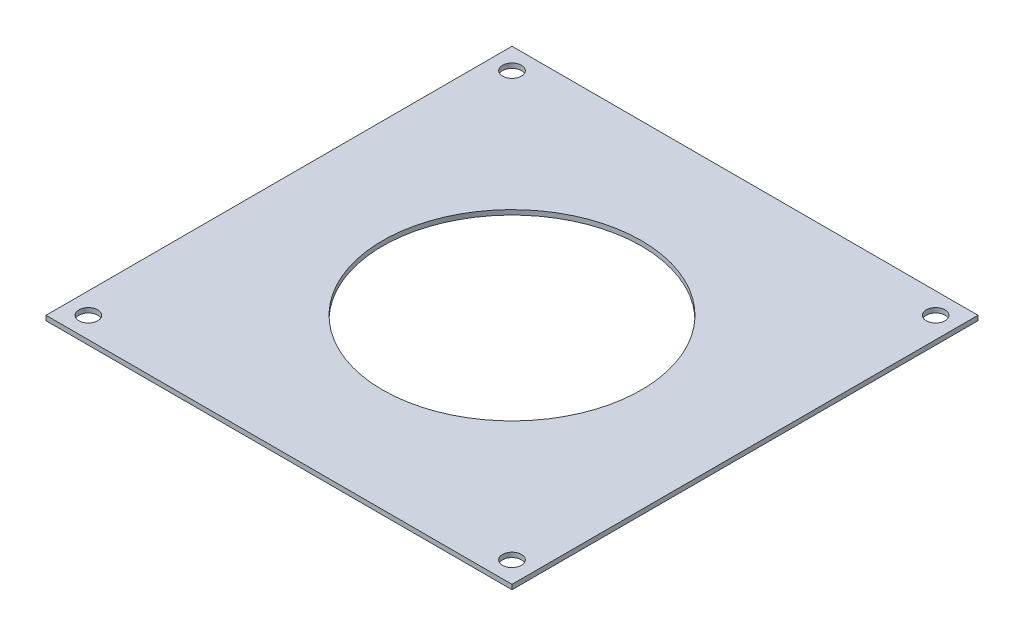
ISO-10303-21;
HEADER;
FILE_DESCRIPTION(('STEP AP214'),'2;1');
FILE_NAME('part.step','',(''),(''),'','','');
FILE_SCHEMA(('AUTOMOTIVE_DESIGN { 1 0 10303 214 1 1 1 1 }'));
ENDSEC;
DATA;
#1=APPLICATION_CONTEXT('core data for automotive mechanical design processes');
#2=APPLICATION_PROTOCOL_DEFINITION('international standard','automotive_design',2000,#1);
#3=PRODUCT_CONTEXT('',#1,'mechanical');
#4=PRODUCT('Part','Part','',(#3));
#5=PRODUCT_RELATED_PRODUCT_CATEGORY('part','',(#4));
#6=PRODUCT_DEFINITION_FORMATION('','',#4);
#7=PRODUCT_DEFINITION_CONTEXT('part definition',#1,'design');
#8=PRODUCT_DEFINITION('design','',#6,#7);
#9=PRODUCT_DEFINITION_SHAPE('','',#8);
#10=(LENGTH_UNIT() NAMED_UNIT(*) SI_UNIT(.MILLI.,.METRE.));
#11=(NAMED_UNIT(*) PLANE_ANGLE_UNIT() SI_UNIT($,.RADIAN.));
#12=(NAMED_UNIT(*) SI_UNIT($,.STERADIAN.) SOLID_ANGLE_UNIT());
#13=UNCERTAINTY_MEASURE_WITH_UNIT(LENGTH_MEASURE(1.E-05),#10,'distance_accuracy_value','');
#14=(GEOMETRIC_REPRESENTATION_CONTEXT(3) GLOBAL_UNCERTAINTY_ASSIGNED_CONTEXT((#13)) GLOBAL_UNIT_ASSIGNED_CONTEXT((#10,
#11,#12)) REPRESENTATION_CONTEXT('',''));
#15=CARTESIAN_POINT('',(0.,0.,0.));
#16=DIRECTION('',(0.,0.,1.));
#17=DIRECTION('',(1.,0.,0.));
#18=AXIS2_PLACEMENT_3D('',#15,#16,#17);
#19=CARTESIAN_POINT('',(49.3914086658803,1.000000032,49.3914086658803));
#20=DIRECTION('',(-1.,0.,0.));
#21=DIRECTION('',(0.,0.,1.));
#22=AXIS2_PLACEMENT_3D('',#19,#20,#21);
#23=PLANE('',#22);
#24=DIRECTION('',(0.,0.,-1.));
#25=VECTOR('',#24,1.);
#26=CARTESIAN_POINT('',(49.3914086658803,0.,49.3914086658803));
#27=LINE('',#26,#25);
#28=CARTESIAN_POINT('',(49.3914086658803,0.,49.3914086658803));
#29=VERTEX_POINT('',#28);
#30=CARTESIAN_POINT('',(49.3914086658803,0.,-49.3914086658804));
#31=VERTEX_POINT('',#30);
#32=EDGE_CURVE('E102',#29,#31,#27,.T.);
#33=ORIENTED_EDGE('',*,*,#32,.T.);
#34=DIRECTION('',(0.,-1.,0.));
#35=VECTOR('',#34,1.);
#36=CARTESIAN_POINT('',(49.3914086658803,1.000000032,-49.3914086658804));
#37=LINE('',#36,#35);
#38=CARTESIAN_POINT('',(49.3914086658803,1.000000032,-49.3914086658804));
#39=VERTEX_POINT('',#38);
#40=EDGE_CURVE('E11',#39,#31,#37,.T.);
#41=ORIENTED_EDGE('',*,*,#40,.F.);
#42=DIRECTION('',(0.,0.,-1.));
#43=VECTOR('',#42,1.);
#44=CARTESIAN_POINT('',(49.3914086658803,1.000000032,49.3914086658803));
#45=LINE('',#44,#43);
#46=CARTESIAN_POINT('',(49.3914086658803,1.000000032,49.3914086658803));
#47=VERTEX_POINT('',#46);
#48=EDGE_CURVE('E90',#47,#39,#45,.T.);
#49=ORIENTED_EDGE('',*,*,#48,.F.);
#50=DIRECTION('',(0.,-1.,0.));
#51=VECTOR('',#50,1.);
#52=CARTESIAN_POINT('',(49.3914086658803,1.000000032,49.3914086658803));
#53=LINE('',#52,#51);
#54=EDGE_CURVE('E98',#47,#29,#53,.T.);
#55=ORIENTED_EDGE('',*,*,#54,.T.);
#56=EDGE_LOOP('',(#33,#41,#49,#55));
#57=FACE_BOUND('',#56,.T.);
#58=ADVANCED_FACE('F39',(#57),#23,.F.);
#59=CARTESIAN_POINT('',(-49.3914086658803,1.000000032,-49.3914086658804));
#60=DIRECTION('',(0.,0.,1.));
#61=DIRECTION('',(1.,0.,0.));
#62=AXIS2_PLACEMENT_3D('',#59,#60,#61);
#63=PLANE('',#62);
#64=DIRECTION('',(-1.,0.,0.));
#65=VECTOR('',#64,1.);
#66=CARTESIAN_POINT('',(-49.3914086658803,0.,-49.3914086658804));
#67=LINE('',#66,#65);
#68=CARTESIAN_POINT('',(-49.3914086658803,0.,-49.3914086658804));
#69=VERTEX_POINT('',#68);
#70=EDGE_CURVE('E94',#31,#69,#67,.T.);
#71=ORIENTED_EDGE('',*,*,#70,.T.);
#72=DIRECTION('',(0.,-1.,0.));
#73=VECTOR('',#72,1.);
#74=CARTESIAN_POINT('',(-49.3914086658803,1.000000032,-49.3914086658804));
#75=LINE('',#74,#73);
#76=CARTESIAN_POINT('',(-49.3914086658803,1.000000032,-49.3914086658804));
#77=VERTEX_POINT('',#76);
#78=EDGE_CURVE('E47',#77,#69,#75,.T.);
#79=ORIENTED_EDGE('',*,*,#78,.F.);
#80=DIRECTION('',(-1.,0.,0.));
#81=VECTOR('',#80,1.);
#82=CARTESIAN_POINT('',(-49.3914086658803,1.000000032,-49.3914086658804));
#83=LINE('',#82,#81);
#84=EDGE_CURVE('E85',#39,#77,#83,.T.);
#85=ORIENTED_EDGE('',*,*,#84,.F.);
#86=ORIENTED_EDGE('',*,*,#40,.T.);
#87=EDGE_LOOP('',(#71,#79,#85,#86));
#88=FACE_BOUND('',#87,.T.);
#89=ADVANCED_FACE('F93',(#88),#63,.F.);
#90=CARTESIAN_POINT('',(-49.3914086658803,1.000000032,49.3914086658803));
#91=DIRECTION('',(1.,0.,0.));
#92=DIRECTION('',(0.,0.,-1.));
#93=AXIS2_PLACEMENT_3D('',#90,#91,#92);
#94=PLANE('',#93);
#95=DIRECTION('',(0.,0.,1.));
#96=VECTOR('',#95,1.);
#97=CARTESIAN_POINT('',(-49.3914086658803,0.,49.3914086658803));
#98=LINE('',#97,#96);
#99=CARTESIAN_POINT('',(-49.3914086658803,0.,49.3914086658803));
#100=VERTEX_POINT('',#99);
#101=EDGE_CURVE('E72',#69,#100,#98,.T.);
#102=ORIENTED_EDGE('',*,*,#101,.T.);
#103=DIRECTION('',(0.,-1.,0.));
#104=VECTOR('',#103,1.);
#105=CARTESIAN_POINT('',(-49.3914086658803,1.000000032,49.3914086658803));
#106=LINE('',#105,#104);
#107=CARTESIAN_POINT('',(-49.3914086658803,1.000000032,49.3914086658803));
#108=VERTEX_POINT('',#107);
#109=EDGE_CURVE('E95',#108,#100,#106,.T.);
#110=ORIENTED_EDGE('',*,*,#109,.F.);
#111=DIRECTION('',(0.,0.,1.));
#112=VECTOR('',#111,1.);
#113=CARTESIAN_POINT('',(-49.3914086658803,1.000000032,49.3914086658803));
#114=LINE('',#113,#112);
#115=EDGE_CURVE('E88',#77,#108,#114,.T.);
#116=ORIENTED_EDGE('',*,*,#115,.F.);
#117=ORIENTED_EDGE('',*,*,#78,.T.);
#118=EDGE_LOOP('',(#102,#110,#116,#117));
#119=FACE_BOUND('',#118,.T.);
#120=ADVANCED_FACE('F96',(#119),#94,.F.);
#121=CARTESIAN_POINT('',(-49.3914086658803,1.000000032,49.3914086658803));
#122=DIRECTION('',(0.,0.,-1.));
#123=DIRECTION('',(-1.,0.,0.));
#124=AXIS2_PLACEMENT_3D('',#121,#122,#123);
#125=PLANE('',#124);
#126=DIRECTION('',(1.,0.,0.));
#127=VECTOR('',#126,1.);
#128=CARTESIAN_POINT('',(-49.3914086658803,0.,49.3914086658803));
#129=LINE('',#128,#127);
#130=EDGE_CURVE('E78',#100,#29,#129,.T.);
#131=ORIENTED_EDGE('',*,*,#130,.T.);
#132=ORIENTED_EDGE('',*,*,#54,.F.);
#133=DIRECTION('',(1.,0.,0.));
#134=VECTOR('',#133,1.);
#135=CARTESIAN_POINT('',(-49.3914086658803,1.000000032,49.3914086658803));
#136=LINE('',#135,#134);
#137=EDGE_CURVE('E55',#108,#47,#136,.T.);
#138=ORIENTED_EDGE('',*,*,#137,.F.);
#139=ORIENTED_EDGE('',*,*,#109,.T.);
#140=EDGE_LOOP('',(#131,#132,#138,#139));
#141=FACE_BOUND('',#140,.T.);
#142=ADVANCED_FACE('F110',(#141),#125,.F.);
#143=CARTESIAN_POINT('',(0.,1.000000032,0.));
#144=DIRECTION('',(0.,-1.,0.));
#145=DIRECTION('',(0.,0.,-1.));
#146=AXIS2_PLACEMENT_3D('',#143,#144,#145);
#147=PLANE('',#146);
#148=CARTESIAN_POINT('',(0.,1.000000032,0.));
#149=DIRECTION('',(0.,1.,0.));
#150=DIRECTION('',(0.,0.,1.));
#151=AXIS2_PLACEMENT_3D('',#148,#149,#150);
#152=CIRCLE('',#151,27.432);
#153=CARTESIAN_POINT('',(0.,1.000000032,27.432));
#154=VERTEX_POINT('',#153);
#155=EDGE_CURVE('E126',#154,#154,#152,.T.);
#156=ORIENTED_EDGE('',*,*,#155,.F.);
#157=EDGE_LOOP('',(#156));
#158=FACE_BOUND('',#157,.T.);
#159=CARTESIAN_POINT('',(-44.9012806053458,1.000000032,-44.9012806053457));
#160=DIRECTION('',(0.,1.,0.));
#161=DIRECTION('',(0.,0.,1.));
#162=AXIS2_PLACEMENT_3D('',#159,#160,#161);
#163=CIRCLE('',#162,2.000000064);
#164=CARTESIAN_POINT('',(-44.9012806053458,1.000000032,-42.9012805413457));
#165=VERTEX_POINT('',#164);
#166=EDGE_CURVE('E122',#165,#165,#163,.T.);
#167=ORIENTED_EDGE('',*,*,#166,.F.);
#168=EDGE_LOOP('',(#167));
#169=FACE_BOUND('',#168,.T.);
#170=CARTESIAN_POINT('',(-44.9012806053457,1.000000032,44.9012806053458));
#171=DIRECTION('',(0.,1.,0.));
#172=DIRECTION('',(0.,0.,1.));
#173=AXIS2_PLACEMENT_3D('',#170,#171,#172);
#174=CIRCLE('',#173,2.000000064);
#175=CARTESIAN_POINT('',(-44.9012806053457,1.000000032,46.9012806693458));
#176=VERTEX_POINT('',#175);
#177=EDGE_CURVE('E129',#176,#176,#174,.T.);
#178=ORIENTED_EDGE('',*,*,#177,.F.);
#179=EDGE_LOOP('',(#178));
#180=FACE_BOUND('',#179,.T.);
#181=CARTESIAN_POINT('',(44.9012806053458,1.000000032,44.9012806053458));
#182=DIRECTION('',(0.,1.,0.));
#183=DIRECTION('',(0.,0.,1.));
#184=AXIS2_PLACEMENT_3D('',#181,#182,#183);
#185=CIRCLE('',#184,2.000000064);
#186=CARTESIAN_POINT('',(44.9012806053458,1.000000032,46.9012806693458));
#187=VERTEX_POINT('',#186);
#188=EDGE_CURVE('E135',#187,#187,#185,.T.);
#189=ORIENTED_EDGE('',*,*,#188,.F.);
#190=EDGE_LOOP('',(#189));
#191=FACE_BOUND('',#190,.T.);
#192=CARTESIAN_POINT('',(44.9012806053458,1.000000032,-44.9012806053458));
#193=DIRECTION('',(0.,1.,0.));
#194=DIRECTION('',(0.,0.,1.));
#195=AXIS2_PLACEMENT_3D('',#192,#193,#194);
#196=CIRCLE('',#195,2.000000064);
#197=CARTESIAN_POINT('',(44.9012806053458,1.000000032,-42.9012805413458));
#198=VERTEX_POINT('',#197);
#199=EDGE_CURVE('E105',#198,#198,#196,.T.);
#200=ORIENTED_EDGE('',*,*,#199,.F.);
#201=EDGE_LOOP('',(#200));
#202=FACE_BOUND('',#201,.T.);
#203=ORIENTED_EDGE('',*,*,#48,.T.);
#204=ORIENTED_EDGE('',*,*,#84,.T.);
#205=ORIENTED_EDGE('',*,*,#115,.T.);
#206=ORIENTED_EDGE('',*,*,#137,.T.);
#207=EDGE_LOOP('',(#203,#204,#205,#206));
#208=FACE_BOUND('',#207,.T.);
#209=ADVANCED_FACE('F86',(#158,#169,#180,#191,#202,#208),#147,.F.);
#210=CARTESIAN_POINT('',(0.,0.,0.));
#211=DIRECTION('',(0.,-1.,0.));
#212=DIRECTION('',(0.,0.,-1.));
#213=AXIS2_PLACEMENT_3D('',#210,#211,#212);
#214=PLANE('',#213);
#215=CARTESIAN_POINT('',(0.,0.,0.));
#216=DIRECTION('',(0.,1.,0.));
#217=DIRECTION('',(0.,0.,1.));
#218=AXIS2_PLACEMENT_3D('',#215,#216,#217);
#219=CIRCLE('',#218,27.432);
#220=CARTESIAN_POINT('',(0.,0.,27.432));
#221=VERTEX_POINT('',#220);
#222=EDGE_CURVE('E140',#221,#221,#219,.T.);
#223=ORIENTED_EDGE('',*,*,#222,.T.);
#224=EDGE_LOOP('',(#223));
#225=FACE_BOUND('',#224,.T.);
#226=CARTESIAN_POINT('',(-44.9012806053458,0.,-44.9012806053457));
#227=DIRECTION('',(0.,1.,0.));
#228=DIRECTION('',(0.,0.,1.));
#229=AXIS2_PLACEMENT_3D('',#226,#227,#228);
#230=CIRCLE('',#229,2.000000064);
#231=CARTESIAN_POINT('',(-44.9012806053458,0.,-42.9012805413457));
#232=VERTEX_POINT('',#231);
#233=EDGE_CURVE('E125',#232,#232,#230,.T.);
#234=ORIENTED_EDGE('',*,*,#233,.T.);
#235=EDGE_LOOP('',(#234));
#236=FACE_BOUND('',#235,.T.);
#237=CARTESIAN_POINT('',(-44.9012806053457,0.,44.9012806053458));
#238=DIRECTION('',(0.,1.,0.));
#239=DIRECTION('',(0.,0.,1.));
#240=AXIS2_PLACEMENT_3D('',#237,#238,#239);
#241=CIRCLE('',#240,2.000000064);
#242=CARTESIAN_POINT('',(-44.9012806053457,0.,46.9012806693458));
#243=VERTEX_POINT('',#242);
#244=EDGE_CURVE('E132',#243,#243,#241,.T.);
#245=ORIENTED_EDGE('',*,*,#244,.T.);
#246=EDGE_LOOP('',(#245));
#247=FACE_BOUND('',#246,.T.);
#248=CARTESIAN_POINT('',(44.9012806053458,0.,44.9012806053458));
#249=DIRECTION('',(0.,1.,0.));
#250=DIRECTION('',(0.,0.,1.));
#251=AXIS2_PLACEMENT_3D('',#248,#249,#250);
#252=CIRCLE('',#251,2.000000064);
#253=CARTESIAN_POINT('',(44.9012806053458,0.,46.9012806693458));
#254=VERTEX_POINT('',#253);
#255=EDGE_CURVE('E119',#254,#254,#252,.T.);
#256=ORIENTED_EDGE('',*,*,#255,.T.);
#257=EDGE_LOOP('',(#256));
#258=FACE_BOUND('',#257,.T.);
#259=CARTESIAN_POINT('',(44.9012806053458,0.,-44.9012806053458));
#260=DIRECTION('',(0.,1.,0.));
#261=DIRECTION('',(0.,0.,1.));
#262=AXIS2_PLACEMENT_3D('',#259,#260,#261);
#263=CIRCLE('',#262,2.000000064);
#264=CARTESIAN_POINT('',(44.9012806053458,0.,-42.9012805413458));
#265=VERTEX_POINT('',#264);
#266=EDGE_CURVE('E116',#265,#265,#263,.T.);
#267=ORIENTED_EDGE('',*,*,#266,.T.);
#268=EDGE_LOOP('',(#267));
#269=FACE_BOUND('',#268,.T.);
#270=ORIENTED_EDGE('',*,*,#32,.F.);
#271=ORIENTED_EDGE('',*,*,#130,.F.);
#272=ORIENTED_EDGE('',*,*,#101,.F.);
#273=ORIENTED_EDGE('',*,*,#70,.F.);
#274=EDGE_LOOP('',(#270,#271,#272,#273));
#275=FACE_BOUND('',#274,.T.);
#276=ADVANCED_FACE('F113',(#225,#236,#247,#258,#269,#275),#214,.T.);
#277=CARTESIAN_POINT('',(44.9012806053458,1.000000032,-44.9012806053458));
#278=DIRECTION('',(0.,-1.,0.));
#279=DIRECTION('',(0.,0.,-1.));
#280=AXIS2_PLACEMENT_3D('',#277,#278,#279);
#281=CYLINDRICAL_SURFACE('',#280,2.000000064);
#282=ORIENTED_EDGE('',*,*,#199,.T.);
#283=EDGE_LOOP('',(#282));
#284=FACE_BOUND('',#283,.T.);
#285=ORIENTED_EDGE('',*,*,#266,.F.);
#286=EDGE_LOOP('',(#285));
#287=FACE_BOUND('',#286,.T.);
#288=ADVANCED_FACE('F160',(#284,#287),#281,.F.);
#289=CARTESIAN_POINT('',(44.9012806053458,1.000000032,44.9012806053458));
#290=DIRECTION('',(0.,-1.,0.));
#291=DIRECTION('',(0.,0.,-1.));
#292=AXIS2_PLACEMENT_3D('',#289,#290,#291);
#293=CYLINDRICAL_SURFACE('',#292,2.000000064);
#294=ORIENTED_EDGE('',*,*,#188,.T.);
#295=EDGE_LOOP('',(#294));
#296=FACE_BOUND('',#295,.T.);
#297=ORIENTED_EDGE('',*,*,#255,.F.);
#298=EDGE_LOOP('',(#297));
#299=FACE_BOUND('',#298,.T.);
#300=ADVANCED_FACE('F163',(#296,#299),#293,.F.);
#301=CARTESIAN_POINT('',(-44.9012806053457,1.000000032,44.9012806053458));
#302=DIRECTION('',(0.,-1.,0.));
#303=DIRECTION('',(0.,0.,-1.));
#304=AXIS2_PLACEMENT_3D('',#301,#302,#303);
#305=CYLINDRICAL_SURFACE('',#304,2.000000064);
#306=ORIENTED_EDGE('',*,*,#177,.T.);
#307=EDGE_LOOP('',(#306));
#308=FACE_BOUND('',#307,.T.);
#309=ORIENTED_EDGE('',*,*,#244,.F.);
#310=EDGE_LOOP('',(#309));
#311=FACE_BOUND('',#310,.T.);
#312=ADVANCED_FACE('F201',(#308,#311),#305,.F.);
#313=CARTESIAN_POINT('',(-44.9012806053458,1.000000032,-44.9012806053457));
#314=DIRECTION('',(0.,-1.,0.));
#315=DIRECTION('',(0.,0.,-1.));
#316=AXIS2_PLACEMENT_3D('',#313,#314,#315);
#317=CYLINDRICAL_SURFACE('',#316,2.000000064);
#318=ORIENTED_EDGE('',*,*,#166,.T.);
#319=EDGE_LOOP('',(#318));
#320=FACE_BOUND('',#319,.T.);
#321=ORIENTED_EDGE('',*,*,#233,.F.);
#322=EDGE_LOOP('',(#321));
#323=FACE_BOUND('',#322,.T.);
#324=ADVANCED_FACE('F210',(#320,#323),#317,.F.);
#325=CARTESIAN_POINT('',(0.,1.000000032,0.));
#326=DIRECTION('',(0.,-1.,0.));
#327=DIRECTION('',(0.,0.,-1.));
#328=AXIS2_PLACEMENT_3D('',#325,#326,#327);
#329=CYLINDRICAL_SURFACE('',#328,27.432);
#330=ORIENTED_EDGE('',*,*,#155,.T.);
#331=EDGE_LOOP('',(#330));
#332=FACE_BOUND('',#331,.T.);
#333=ORIENTED_EDGE('',*,*,#222,.F.);
#334=EDGE_LOOP('',(#333));
#335=FACE_BOUND('',#334,.T.);
#336=ADVANCED_FACE('F146',(#332,#335),#329,.F.);
#337=CLOSED_SHELL('',(#58,#89,#120,#142,#209,#276,#288,#300,#312,#324,#336));
#338=MANIFOLD_SOLID_BREP('B2',#337);
#339=ADVANCED_BREP_SHAPE_REPRESENTATION('',(#18,#338),#14);
#340=SHAPE_DEFINITION_REPRESENTATION(#9,#339);
ENDSEC;
END-ISO-10303-21;
